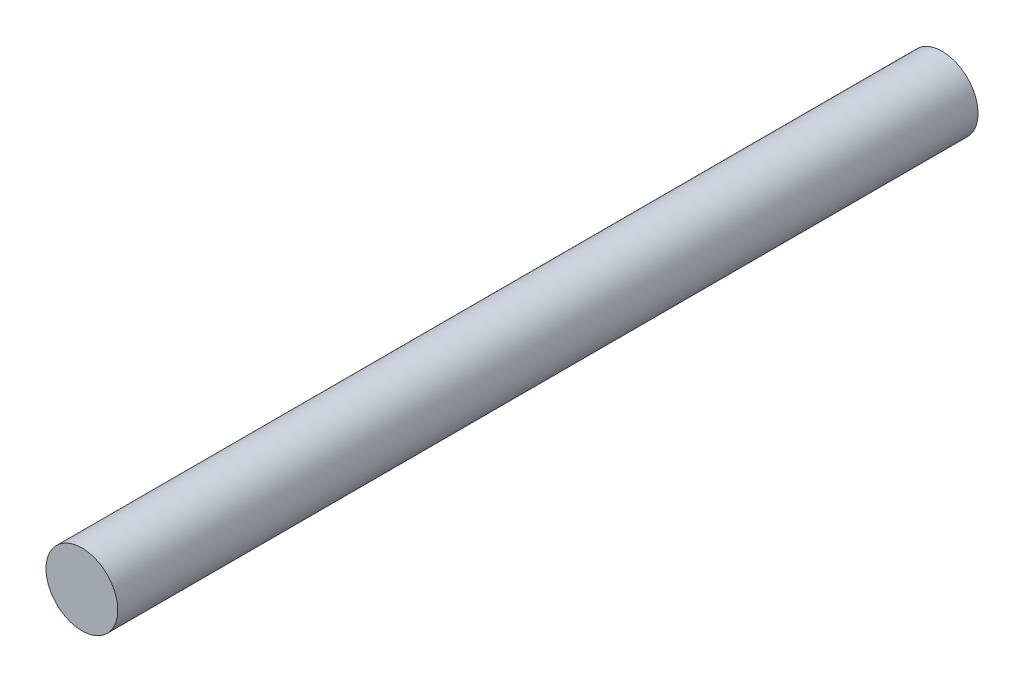
ISO-10303-21;
HEADER;
FILE_DESCRIPTION(('STEP AP214'),'2;1');
FILE_NAME('part.step','',(''),(''),'','','');
FILE_SCHEMA(('AUTOMOTIVE_DESIGN { 1 0 10303 214 1 1 1 1 }'));
ENDSEC;
DATA;
#1=APPLICATION_CONTEXT('core data for automotive mechanical design processes');
#2=APPLICATION_PROTOCOL_DEFINITION('international standard','automotive_design',2000,#1);
#3=PRODUCT_CONTEXT('',#1,'mechanical');
#4=PRODUCT('Part','Part','',(#3));
#5=PRODUCT_RELATED_PRODUCT_CATEGORY('part','',(#4));
#6=PRODUCT_DEFINITION_FORMATION('','',#4);
#7=PRODUCT_DEFINITION_CONTEXT('part definition',#1,'design');
#8=PRODUCT_DEFINITION('design','',#6,#7);
#9=PRODUCT_DEFINITION_SHAPE('','',#8);
#10=(LENGTH_UNIT() NAMED_UNIT(*) SI_UNIT(.MILLI.,.METRE.));
#11=(NAMED_UNIT(*) PLANE_ANGLE_UNIT() SI_UNIT($,.RADIAN.));
#12=(NAMED_UNIT(*) SI_UNIT($,.STERADIAN.) SOLID_ANGLE_UNIT());
#13=UNCERTAINTY_MEASURE_WITH_UNIT(LENGTH_MEASURE(1.E-05),#10,'distance_accuracy_value','');
#14=(GEOMETRIC_REPRESENTATION_CONTEXT(3) GLOBAL_UNCERTAINTY_ASSIGNED_CONTEXT((#13)) GLOBAL_UNIT_ASSIGNED_CONTEXT((#10,
#11,#12)) REPRESENTATION_CONTEXT('',''));
#15=CARTESIAN_POINT('',(0.,0.,0.));
#16=DIRECTION('',(0.,0.,1.));
#17=DIRECTION('',(1.,0.,0.));
#18=AXIS2_PLACEMENT_3D('',#15,#16,#17);
#19=CARTESIAN_POINT('',(0.52999894,0.,0.));
#20=DIRECTION('',(0.,0.,-1.));
#21=DIRECTION('',(-1.,0.,0.));
#22=AXIS2_PLACEMENT_3D('',#19,#20,#21);
#23=PLANE('',#22);
#24=CARTESIAN_POINT('',(0.,0.,0.));
#25=DIRECTION('',(0.,0.,-1.));
#26=DIRECTION('',(-1.,0.,0.));
#27=AXIS2_PLACEMENT_3D('',#24,#25,#26);
#28=CIRCLE('',#27,0.52999894);
#29=CARTESIAN_POINT('',(-0.52999894,0.,0.));
#30=VERTEX_POINT('',#29);
#31=EDGE_CURVE('E18',#30,#30,#28,.F.);
#32=ORIENTED_EDGE('',*,*,#31,.F.);
#33=EDGE_LOOP('',(#32));
#34=FACE_BOUND('',#33,.T.);
#35=ADVANCED_FACE('F15',(#34),#23,.T.);
#36=CARTESIAN_POINT('',(0.52999894,0.,12.7));
#37=DIRECTION('',(0.,0.,-1.));
#38=DIRECTION('',(-1.,0.,0.));
#39=AXIS2_PLACEMENT_3D('',#36,#37,#38);
#40=PLANE('',#39);
#41=CARTESIAN_POINT('',(0.,0.,12.7));
#42=DIRECTION('',(0.,0.,-1.));
#43=DIRECTION('',(-1.,0.,0.));
#44=AXIS2_PLACEMENT_3D('',#41,#42,#43);
#45=CIRCLE('',#44,0.52999894);
#46=CARTESIAN_POINT('',(-0.52999894,0.,12.7));
#47=VERTEX_POINT('',#46);
#48=EDGE_CURVE('E10',#47,#47,#45,.T.);
#49=ORIENTED_EDGE('',*,*,#48,.F.);
#50=EDGE_LOOP('',(#49));
#51=FACE_BOUND('',#50,.T.);
#52=ADVANCED_FACE('F30',(#51),#40,.F.);
#53=CARTESIAN_POINT('',(0.,0.,0.));
#54=DIRECTION('',(0.,0.,-1.));
#55=DIRECTION('',(-1.,0.,0.));
#56=AXIS2_PLACEMENT_3D('',#53,#54,#55);
#57=CYLINDRICAL_SURFACE('',#56,0.52999894);
#58=ORIENTED_EDGE('',*,*,#48,.T.);
#59=EDGE_LOOP('',(#58));
#60=FACE_BOUND('',#59,.T.);
#61=ORIENTED_EDGE('',*,*,#31,.T.);
#62=EDGE_LOOP('',(#61));
#63=FACE_BOUND('',#62,.T.);
#64=ADVANCED_FACE('F27',(#60,#63),#57,.T.);
#65=CLOSED_SHELL('',(#35,#52,#64));
#66=MANIFOLD_SOLID_BREP('B1',#65);
#67=ADVANCED_BREP_SHAPE_REPRESENTATION('',(#18,#66),#14);
#68=SHAPE_DEFINITION_REPRESENTATION(#9,#67);
ENDSEC;
END-ISO-10303-21;
